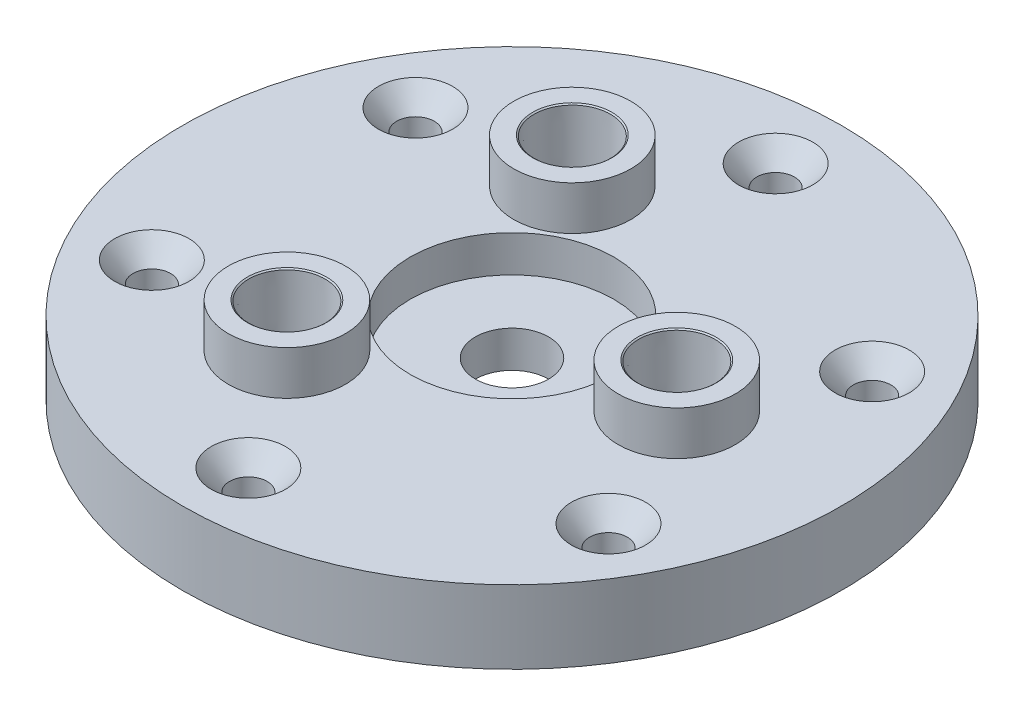
ISO-10303-21;
HEADER;
FILE_DESCRIPTION(('STEP AP214'),'2;1');
FILE_NAME('part.step','',(''),(''),'','','');
FILE_SCHEMA(('AUTOMOTIVE_DESIGN { 1 0 10303 214 1 1 1 1 }'));
ENDSEC;
DATA;
#1=APPLICATION_CONTEXT('core data for automotive mechanical design processes');
#2=APPLICATION_PROTOCOL_DEFINITION('international standard','automotive_design',2000,#1);
#3=PRODUCT_CONTEXT('',#1,'mechanical');
#4=PRODUCT('Part','Part','',(#3));
#5=PRODUCT_RELATED_PRODUCT_CATEGORY('part','',(#4));
#6=PRODUCT_DEFINITION_FORMATION('','',#4);
#7=PRODUCT_DEFINITION_CONTEXT('part definition',#1,'design');
#8=PRODUCT_DEFINITION('design','',#6,#7);
#9=PRODUCT_DEFINITION_SHAPE('','',#8);
#10=(LENGTH_UNIT() NAMED_UNIT(*) SI_UNIT(.MILLI.,.METRE.));
#11=(NAMED_UNIT(*) PLANE_ANGLE_UNIT() SI_UNIT($,.RADIAN.));
#12=(NAMED_UNIT(*) SI_UNIT($,.STERADIAN.) SOLID_ANGLE_UNIT());
#13=UNCERTAINTY_MEASURE_WITH_UNIT(LENGTH_MEASURE(1.E-05),#10,'distance_accuracy_value','');
#14=(GEOMETRIC_REPRESENTATION_CONTEXT(3) GLOBAL_UNCERTAINTY_ASSIGNED_CONTEXT((#13)) GLOBAL_UNIT_ASSIGNED_CONTEXT((#10,
#11,#12)) REPRESENTATION_CONTEXT('',''));
#15=CARTESIAN_POINT('',(0.,0.,0.));
#16=DIRECTION('',(0.,0.,1.));
#17=DIRECTION('',(1.,0.,0.));
#18=AXIS2_PLACEMENT_3D('',#15,#16,#17);
#19=CARTESIAN_POINT('',(0.,12.7,0.));
#20=DIRECTION('',(0.,1.,0.));
#21=DIRECTION('',(0.,0.,1.));
#22=AXIS2_PLACEMENT_3D('',#19,#20,#21);
#23=PLANE('',#22);
#24=CARTESIAN_POINT('',(28.575,12.7,0.));
#25=DIRECTION('',(0.,1.,0.));
#26=DIRECTION('',(0.,0.,1.));
#27=AXIS2_PLACEMENT_3D('',#24,#25,#26);
#28=CIRCLE('',#27,10.16);
#29=CARTESIAN_POINT('',(28.575,12.7,10.16));
#30=VERTEX_POINT('',#29);
#31=EDGE_CURVE('E92',#30,#30,#28,.T.);
#32=ORIENTED_EDGE('',*,*,#31,.F.);
#33=EDGE_LOOP('',(#32));
#34=FACE_BOUND('',#33,.T.);
#35=CARTESIAN_POINT('',(0.,12.7,0.));
#36=DIRECTION('',(0.,1.,0.));
#37=DIRECTION('',(0.,0.,1.));
#38=AXIS2_PLACEMENT_3D('',#35,#36,#37);
#39=CIRCLE('',#38,17.653);
#40=CARTESIAN_POINT('',(0.,12.7,17.653));
#41=VERTEX_POINT('',#40);
#42=EDGE_CURVE('E170',#41,#41,#39,.T.);
#43=ORIENTED_EDGE('',*,*,#42,.F.);
#44=EDGE_LOOP('',(#43));
#45=FACE_BOUND('',#44,.T.);
#46=CARTESIAN_POINT('',(0.,12.7,0.));
#47=DIRECTION('',(0.,1.,0.));
#48=DIRECTION('',(0.,0.,1.));
#49=AXIS2_PLACEMENT_3D('',#46,#47,#48);
#50=CIRCLE('',#49,57.15);
#51=CARTESIAN_POINT('',(0.,12.7,57.15));
#52=VERTEX_POINT('',#51);
#53=EDGE_CURVE('E173',#52,#52,#50,.T.);
#54=ORIENTED_EDGE('',*,*,#53,.T.);
#55=EDGE_LOOP('',(#54));
#56=FACE_BOUND('',#55,.T.);
#57=CARTESIAN_POINT('',(0.,12.7,-45.72));
#58=DIRECTION('',(0.,1.,0.));
#59=DIRECTION('',(0.,0.,1.));
#60=AXIS2_PLACEMENT_3D('',#57,#58,#59);
#61=CIRCLE('',#60,6.4389);
#62=CARTESIAN_POINT('',(0.,12.7,-39.2811));
#63=VERTEX_POINT('',#62);
#64=EDGE_CURVE('E151',#63,#63,#61,.T.);
#65=ORIENTED_EDGE('',*,*,#64,.F.);
#66=EDGE_LOOP('',(#65));
#67=FACE_BOUND('',#66,.T.);
#68=CARTESIAN_POINT('',(-39.5946814610246,12.7,-22.8599999999999));
#69=DIRECTION('',(0.,1.,0.));
#70=DIRECTION('',(0.,0.,1.));
#71=AXIS2_PLACEMENT_3D('',#68,#69,#70);
#72=CIRCLE('',#71,6.4389);
#73=CARTESIAN_POINT('',(-39.5946814610246,12.7,-16.4210999999999));
#74=VERTEX_POINT('',#73);
#75=EDGE_CURVE('E142',#74,#74,#72,.T.);
#76=ORIENTED_EDGE('',*,*,#75,.F.);
#77=EDGE_LOOP('',(#76));
#78=FACE_BOUND('',#77,.T.);
#79=CARTESIAN_POINT('',(-39.5946814610244,12.7,22.8600000000002));
#80=DIRECTION('',(0.,1.,0.));
#81=DIRECTION('',(0.,0.,1.));
#82=AXIS2_PLACEMENT_3D('',#79,#80,#81);
#83=CIRCLE('',#82,6.4389);
#84=CARTESIAN_POINT('',(-39.5946814610244,12.7,29.2989000000002));
#85=VERTEX_POINT('',#84);
#86=EDGE_CURVE('E133',#85,#85,#83,.T.);
#87=ORIENTED_EDGE('',*,*,#86,.F.);
#88=EDGE_LOOP('',(#87));
#89=FACE_BOUND('',#88,.T.);
#90=CARTESIAN_POINT('',(0.,12.7,45.72));
#91=DIRECTION('',(0.,1.,0.));
#92=DIRECTION('',(0.,0.,1.));
#93=AXIS2_PLACEMENT_3D('',#90,#91,#92);
#94=CIRCLE('',#93,6.4389);
#95=CARTESIAN_POINT('',(0.,12.7,52.1589));
#96=VERTEX_POINT('',#95);
#97=EDGE_CURVE('E124',#96,#96,#94,.T.);
#98=ORIENTED_EDGE('',*,*,#97,.F.);
#99=EDGE_LOOP('',(#98));
#100=FACE_BOUND('',#99,.T.);
#101=CARTESIAN_POINT('',(39.5946814610247,12.7,22.8599999999996));
#102=DIRECTION('',(0.,1.,0.));
#103=DIRECTION('',(0.,0.,1.));
#104=AXIS2_PLACEMENT_3D('',#101,#102,#103);
#105=CIRCLE('',#104,6.4389);
#106=CARTESIAN_POINT('',(39.5946814610247,12.7,29.2988999999996));
#107=VERTEX_POINT('',#106);
#108=EDGE_CURVE('E115',#107,#107,#105,.T.);
#109=ORIENTED_EDGE('',*,*,#108,.F.);
#110=EDGE_LOOP('',(#109));
#111=FACE_BOUND('',#110,.T.);
#112=CARTESIAN_POINT('',(39.5946814610243,12.7,-22.8600000000005));
#113=DIRECTION('',(0.,1.,0.));
#114=DIRECTION('',(0.,0.,1.));
#115=AXIS2_PLACEMENT_3D('',#112,#113,#114);
#116=CIRCLE('',#115,6.4389);
#117=CARTESIAN_POINT('',(39.5946814610243,12.7,-16.4211000000005));
#118=VERTEX_POINT('',#117);
#119=EDGE_CURVE('E104',#118,#118,#116,.T.);
#120=ORIENTED_EDGE('',*,*,#119,.F.);
#121=EDGE_LOOP('',(#120));
#122=FACE_BOUND('',#121,.T.);
#123=CARTESIAN_POINT('',(-14.2875,12.7,-24.7466759131403));
#124=DIRECTION('',(0.,1.,0.));
#125=DIRECTION('',(0.,0.,1.));
#126=AXIS2_PLACEMENT_3D('',#123,#124,#125);
#127=CIRCLE('',#126,10.16);
#128=CARTESIAN_POINT('',(-14.2875,12.7,-14.5866759131403));
#129=VERTEX_POINT('',#128);
#130=EDGE_CURVE('E98',#129,#129,#127,.T.);
#131=ORIENTED_EDGE('',*,*,#130,.F.);
#132=EDGE_LOOP('',(#131));
#133=FACE_BOUND('',#132,.T.);
#134=CARTESIAN_POINT('',(-14.2875,12.7,24.7466759131403));
#135=DIRECTION('',(0.,1.,0.));
#136=DIRECTION('',(0.,0.,1.));
#137=AXIS2_PLACEMENT_3D('',#134,#135,#136);
#138=CIRCLE('',#137,10.16);
#139=CARTESIAN_POINT('',(-14.2875,12.7,34.9066759131403));
#140=VERTEX_POINT('',#139);
#141=EDGE_CURVE('E58',#140,#140,#138,.T.);
#142=ORIENTED_EDGE('',*,*,#141,.F.);
#143=EDGE_LOOP('',(#142));
#144=FACE_BOUND('',#143,.T.);
#145=ADVANCED_FACE('F39',(#34,#45,#56,#67,#78,#89,#100,#111,#122,#133,#144),#23,.T.);
#146=CARTESIAN_POINT('',(0.,6.35,0.));
#147=DIRECTION('',(0.,1.,0.));
#148=DIRECTION('',(0.,0.,1.));
#149=AXIS2_PLACEMENT_3D('',#146,#147,#148);
#150=PLANE('',#149);
#151=CARTESIAN_POINT('',(0.,6.35,0.));
#152=DIRECTION('',(0.,1.,0.));
#153=DIRECTION('',(0.,0.,1.));
#154=AXIS2_PLACEMENT_3D('',#151,#152,#153);
#155=CIRCLE('',#154,6.35);
#156=CARTESIAN_POINT('',(0.,6.35,6.35));
#157=VERTEX_POINT('',#156);
#158=EDGE_CURVE('E47',#157,#157,#155,.T.);
#159=ORIENTED_EDGE('',*,*,#158,.F.);
#160=EDGE_LOOP('',(#159));
#161=FACE_BOUND('',#160,.T.);
#162=CARTESIAN_POINT('',(0.,6.35,0.));
#163=DIRECTION('',(0.,1.,0.));
#164=DIRECTION('',(0.,0.,1.));
#165=AXIS2_PLACEMENT_3D('',#162,#163,#164);
#166=CIRCLE('',#165,17.653);
#167=CARTESIAN_POINT('',(0.,6.35,17.653));
#168=VERTEX_POINT('',#167);
#169=EDGE_CURVE('E164',#168,#168,#166,.T.);
#170=ORIENTED_EDGE('',*,*,#169,.T.);
#171=EDGE_LOOP('',(#170));
#172=FACE_BOUND('',#171,.T.);
#173=ADVANCED_FACE('F199',(#161,#172),#150,.T.);
#174=CARTESIAN_POINT('',(0.,6.35,0.));
#175=DIRECTION('',(0.,-1.,0.));
#176=DIRECTION('',(0.,0.,-1.));
#177=AXIS2_PLACEMENT_3D('',#174,#175,#176);
#178=CYLINDRICAL_SURFACE('',#177,57.15);
#179=CARTESIAN_POINT('',(0.,0.,0.));
#180=DIRECTION('',(0.,1.,0.));
#181=DIRECTION('',(0.,0.,1.));
#182=AXIS2_PLACEMENT_3D('',#179,#180,#181);
#183=CIRCLE('',#182,57.15);
#184=CARTESIAN_POINT('',(0.,0.,57.15));
#185=VERTEX_POINT('',#184);
#186=EDGE_CURVE('E10',#185,#185,#183,.T.);
#187=ORIENTED_EDGE('',*,*,#186,.T.);
#188=EDGE_LOOP('',(#187));
#189=FACE_BOUND('',#188,.T.);
#190=ORIENTED_EDGE('',*,*,#53,.F.);
#191=EDGE_LOOP('',(#190));
#192=FACE_BOUND('',#191,.T.);
#193=ADVANCED_FACE('F41',(#189,#192),#178,.T.);
#194=CARTESIAN_POINT('',(0.,0.,0.));
#195=DIRECTION('',(0.,1.,0.));
#196=DIRECTION('',(0.,0.,1.));
#197=AXIS2_PLACEMENT_3D('',#194,#195,#196);
#198=PLANE('',#197);
#199=CARTESIAN_POINT('',(39.5946814610243,0.,-22.8600000000005));
#200=DIRECTION('',(0.,1.,0.));
#201=DIRECTION('',(0.,0.,1.));
#202=AXIS2_PLACEMENT_3D('',#199,#200,#201);
#203=CIRCLE('',#202,3.2639);
#204=CARTESIAN_POINT('',(39.5946814610243,0.,-19.5961000000005));
#205=VERTEX_POINT('',#204);
#206=EDGE_CURVE('E112',#205,#205,#203,.T.);
#207=ORIENTED_EDGE('',*,*,#206,.T.);
#208=EDGE_LOOP('',(#207));
#209=FACE_BOUND('',#208,.T.);
#210=CARTESIAN_POINT('',(39.5946814610247,0.,22.8599999999996));
#211=DIRECTION('',(0.,1.,0.));
#212=DIRECTION('',(0.,0.,1.));
#213=AXIS2_PLACEMENT_3D('',#210,#211,#212);
#214=CIRCLE('',#213,3.26389999999999);
#215=CARTESIAN_POINT('',(39.5946814610247,0.,26.1238999999996));
#216=VERTEX_POINT('',#215);
#217=EDGE_CURVE('E121',#216,#216,#214,.T.);
#218=ORIENTED_EDGE('',*,*,#217,.T.);
#219=EDGE_LOOP('',(#218));
#220=FACE_BOUND('',#219,.T.);
#221=CARTESIAN_POINT('',(0.,0.,45.72));
#222=DIRECTION('',(0.,1.,0.));
#223=DIRECTION('',(0.,0.,1.));
#224=AXIS2_PLACEMENT_3D('',#221,#222,#223);
#225=CIRCLE('',#224,3.2639);
#226=CARTESIAN_POINT('',(0.,0.,48.9839));
#227=VERTEX_POINT('',#226);
#228=EDGE_CURVE('E130',#227,#227,#225,.T.);
#229=ORIENTED_EDGE('',*,*,#228,.T.);
#230=EDGE_LOOP('',(#229));
#231=FACE_BOUND('',#230,.T.);
#232=CARTESIAN_POINT('',(-39.5946814610244,0.,22.8600000000002));
#233=DIRECTION('',(0.,1.,0.));
#234=DIRECTION('',(0.,0.,1.));
#235=AXIS2_PLACEMENT_3D('',#232,#233,#234);
#236=CIRCLE('',#235,3.2639);
#237=CARTESIAN_POINT('',(-39.5946814610244,0.,26.1239000000002));
#238=VERTEX_POINT('',#237);
#239=EDGE_CURVE('E139',#238,#238,#236,.T.);
#240=ORIENTED_EDGE('',*,*,#239,.T.);
#241=EDGE_LOOP('',(#240));
#242=FACE_BOUND('',#241,.T.);
#243=CARTESIAN_POINT('',(-39.5946814610246,0.,-22.8599999999999));
#244=DIRECTION('',(0.,1.,0.));
#245=DIRECTION('',(0.,0.,1.));
#246=AXIS2_PLACEMENT_3D('',#243,#244,#245);
#247=CIRCLE('',#246,3.2639);
#248=CARTESIAN_POINT('',(-39.5946814610246,0.,-19.5960999999999));
#249=VERTEX_POINT('',#248);
#250=EDGE_CURVE('E148',#249,#249,#247,.T.);
#251=ORIENTED_EDGE('',*,*,#250,.T.);
#252=EDGE_LOOP('',(#251));
#253=FACE_BOUND('',#252,.T.);
#254=CARTESIAN_POINT('',(0.,0.,-45.72));
#255=DIRECTION('',(0.,1.,0.));
#256=DIRECTION('',(0.,0.,1.));
#257=AXIS2_PLACEMENT_3D('',#254,#255,#256);
#258=CIRCLE('',#257,3.2639);
#259=CARTESIAN_POINT('',(0.,0.,-42.4561));
#260=VERTEX_POINT('',#259);
#261=EDGE_CURVE('E157',#260,#260,#258,.T.);
#262=ORIENTED_EDGE('',*,*,#261,.T.);
#263=EDGE_LOOP('',(#262));
#264=FACE_BOUND('',#263,.T.);
#265=CARTESIAN_POINT('',(28.575,0.,0.));
#266=DIRECTION('',(0.,1.,0.));
#267=DIRECTION('',(0.,0.,1.));
#268=AXIS2_PLACEMENT_3D('',#265,#266,#267);
#269=CIRCLE('',#268,3.175);
#270=CARTESIAN_POINT('',(28.575,0.,3.175));
#271=VERTEX_POINT('',#270);
#272=EDGE_CURVE('E161',#271,#271,#269,.T.);
#273=ORIENTED_EDGE('',*,*,#272,.T.);
#274=EDGE_LOOP('',(#273));
#275=FACE_BOUND('',#274,.T.);
#276=CARTESIAN_POINT('',(-14.2875,0.,24.7466759131403));
#277=DIRECTION('',(0.,1.,0.));
#278=DIRECTION('',(0.,0.,1.));
#279=AXIS2_PLACEMENT_3D('',#276,#277,#278);
#280=CIRCLE('',#279,3.175);
#281=CARTESIAN_POINT('',(-14.2875,0.,27.9216759131403));
#282=VERTEX_POINT('',#281);
#283=EDGE_CURVE('E165',#282,#282,#280,.T.);
#284=ORIENTED_EDGE('',*,*,#283,.T.);
#285=EDGE_LOOP('',(#284));
#286=FACE_BOUND('',#285,.T.);
#287=CARTESIAN_POINT('',(-14.2875,0.,-24.7466759131403));
#288=DIRECTION('',(0.,1.,0.));
#289=DIRECTION('',(0.,0.,1.));
#290=AXIS2_PLACEMENT_3D('',#287,#288,#289);
#291=CIRCLE('',#290,3.175);
#292=CARTESIAN_POINT('',(-14.2875,0.,-21.5716759131403));
#293=VERTEX_POINT('',#292);
#294=EDGE_CURVE('E160',#293,#293,#291,.T.);
#295=ORIENTED_EDGE('',*,*,#294,.T.);
#296=EDGE_LOOP('',(#295));
#297=FACE_BOUND('',#296,.T.);
#298=CARTESIAN_POINT('',(0.,0.,0.));
#299=DIRECTION('',(0.,1.,0.));
#300=DIRECTION('',(0.,0.,1.));
#301=AXIS2_PLACEMENT_3D('',#298,#299,#300);
#302=CIRCLE('',#301,6.35);
#303=CARTESIAN_POINT('',(0.,0.,6.35));
#304=VERTEX_POINT('',#303);
#305=EDGE_CURVE('E52',#304,#304,#302,.T.);
#306=ORIENTED_EDGE('',*,*,#305,.T.);
#307=EDGE_LOOP('',(#306));
#308=FACE_BOUND('',#307,.T.);
#309=ORIENTED_EDGE('',*,*,#186,.F.);
#310=EDGE_LOOP('',(#309));
#311=FACE_BOUND('',#310,.T.);
#312=ADVANCED_FACE('F180',(#209,#220,#231,#242,#253,#264,#275,#286,#297,#308,#311),#198,.F.);
#313=CARTESIAN_POINT('',(0.,0.,0.));
#314=DIRECTION('',(0.,1.,0.));
#315=DIRECTION('',(0.,0.,1.));
#316=AXIS2_PLACEMENT_3D('',#313,#314,#315);
#317=CYLINDRICAL_SURFACE('',#316,6.35);
#318=ORIENTED_EDGE('',*,*,#158,.T.);
#319=EDGE_LOOP('',(#318));
#320=FACE_BOUND('',#319,.T.);
#321=ORIENTED_EDGE('',*,*,#305,.F.);
#322=EDGE_LOOP('',(#321));
#323=FACE_BOUND('',#322,.T.);
#324=ADVANCED_FACE('F183',(#320,#323),#317,.F.);
#325=CARTESIAN_POINT('',(0.,12.7,0.));
#326=DIRECTION('',(0.,-1.,0.));
#327=DIRECTION('',(0.,0.,-1.));
#328=AXIS2_PLACEMENT_3D('',#325,#326,#327);
#329=CYLINDRICAL_SURFACE('',#328,17.653);
#330=ORIENTED_EDGE('',*,*,#42,.T.);
#331=EDGE_LOOP('',(#330));
#332=FACE_BOUND('',#331,.T.);
#333=ORIENTED_EDGE('',*,*,#169,.F.);
#334=EDGE_LOOP('',(#333));
#335=FACE_BOUND('',#334,.T.);
#336=ADVANCED_FACE('F185',(#332,#335),#329,.F.);
#337=CARTESIAN_POINT('',(-14.2875,0.,-24.7466759131403));
#338=DIRECTION('',(0.,1.,0.));
#339=DIRECTION('',(0.,0.,1.));
#340=AXIS2_PLACEMENT_3D('',#337,#338,#339);
#341=CYLINDRICAL_SURFACE('',#340,3.175);
#342=CARTESIAN_POINT('',(-14.2875,1.8165851860098,-24.7466759131403));
#343=DIRECTION('',(0.,1.,0.));
#344=DIRECTION('',(0.,0.,1.));
#345=AXIS2_PLACEMENT_3D('',#342,#343,#344);
#346=CIRCLE('',#345,3.175);
#347=CARTESIAN_POINT('',(-14.2875,1.8165851860098,-21.5716759131403));
#348=VERTEX_POINT('',#347);
#349=EDGE_CURVE('E43',#348,#348,#346,.T.);
#350=ORIENTED_EDGE('',*,*,#349,.T.);
#351=EDGE_LOOP('',(#350));
#352=FACE_BOUND('',#351,.T.);
#353=ORIENTED_EDGE('',*,*,#294,.F.);
#354=EDGE_LOOP('',(#353));
#355=FACE_BOUND('',#354,.T.);
#356=ADVANCED_FACE('F192',(#352,#355),#341,.F.);
#357=CARTESIAN_POINT('',(-14.2875,0.,24.7466759131403));
#358=DIRECTION('',(0.,1.,0.));
#359=DIRECTION('',(0.,0.,1.));
#360=AXIS2_PLACEMENT_3D('',#357,#358,#359);
#361=CYLINDRICAL_SURFACE('',#360,3.175);
#362=CARTESIAN_POINT('',(-14.2875,1.8165851860098,24.7466759131403));
#363=DIRECTION('',(0.,1.,0.));
#364=DIRECTION('',(0.,0.,1.));
#365=AXIS2_PLACEMENT_3D('',#362,#363,#364);
#366=CIRCLE('',#365,3.175);
#367=CARTESIAN_POINT('',(-14.2875,1.8165851860098,27.9216759131403));
#368=VERTEX_POINT('',#367);
#369=EDGE_CURVE('E56',#368,#368,#366,.T.);
#370=ORIENTED_EDGE('',*,*,#369,.T.);
#371=EDGE_LOOP('',(#370));
#372=FACE_BOUND('',#371,.T.);
#373=ORIENTED_EDGE('',*,*,#283,.F.);
#374=EDGE_LOOP('',(#373));
#375=FACE_BOUND('',#374,.T.);
#376=ADVANCED_FACE('F210',(#372,#375),#361,.F.);
#377=CARTESIAN_POINT('',(28.575,0.,0.));
#378=DIRECTION('',(0.,1.,0.));
#379=DIRECTION('',(0.,0.,1.));
#380=AXIS2_PLACEMENT_3D('',#377,#378,#379);
#381=CYLINDRICAL_SURFACE('',#380,3.175);
#382=CARTESIAN_POINT('',(28.575,1.8165851860098,0.));
#383=DIRECTION('',(0.,1.,0.));
#384=DIRECTION('',(0.,0.,1.));
#385=AXIS2_PLACEMENT_3D('',#382,#383,#384);
#386=CIRCLE('',#385,3.175);
#387=CARTESIAN_POINT('',(28.575,1.8165851860098,3.175));
#388=VERTEX_POINT('',#387);
#389=EDGE_CURVE('E60',#388,#388,#386,.T.);
#390=ORIENTED_EDGE('',*,*,#389,.T.);
#391=EDGE_LOOP('',(#390));
#392=FACE_BOUND('',#391,.T.);
#393=ORIENTED_EDGE('',*,*,#272,.F.);
#394=EDGE_LOOP('',(#393));
#395=FACE_BOUND('',#394,.T.);
#396=ADVANCED_FACE('F214',(#392,#395),#381,.F.);
#397=CARTESIAN_POINT('',(0.,12.7,-45.72));
#398=DIRECTION('',(0.,1.,0.));
#399=DIRECTION('',(0.,0.,1.));
#400=AXIS2_PLACEMENT_3D('',#397,#398,#399);
#401=CYLINDRICAL_SURFACE('',#400,3.2639);
#402=ORIENTED_EDGE('',*,*,#261,.F.);
#403=EDGE_LOOP('',(#402));
#404=FACE_BOUND('',#403,.T.);
#405=CARTESIAN_POINT('',(0.,9.04758030707329,-45.72));
#406=DIRECTION('',(0.,1.,0.));
#407=DIRECTION('',(0.,0.,1.));
#408=AXIS2_PLACEMENT_3D('',#405,#406,#407);
#409=CIRCLE('',#408,3.2639);
#410=CARTESIAN_POINT('',(0.,9.04758030707329,-42.4561));
#411=VERTEX_POINT('',#410);
#412=EDGE_CURVE('E154',#411,#411,#409,.T.);
#413=ORIENTED_EDGE('',*,*,#412,.T.);
#414=EDGE_LOOP('',(#413));
#415=FACE_BOUND('',#414,.T.);
#416=ADVANCED_FACE('F218',(#404,#415),#401,.F.);
#417=CARTESIAN_POINT('',(0.,12.7,-45.72));
#418=DIRECTION('',(0.,1.,0.));
#419=DIRECTION('',(0.,0.,1.));
#420=AXIS2_PLACEMENT_3D('',#417,#418,#419);
#421=CONICAL_SURFACE('',#420,6.4389,0.715584993317675);
#422=ORIENTED_EDGE('',*,*,#412,.F.);
#423=EDGE_LOOP('',(#422));
#424=FACE_BOUND('',#423,.T.);
#425=ORIENTED_EDGE('',*,*,#64,.T.);
#426=EDGE_LOOP('',(#425));
#427=FACE_BOUND('',#426,.T.);
#428=ADVANCED_FACE('F221',(#424,#427),#421,.F.);
#429=CARTESIAN_POINT('',(-39.5946814610246,12.7,-22.8599999999999));
#430=DIRECTION('',(0.,1.,0.));
#431=DIRECTION('',(0.,0.,1.));
#432=AXIS2_PLACEMENT_3D('',#429,#430,#431);
#433=CYLINDRICAL_SURFACE('',#432,3.2639);
#434=ORIENTED_EDGE('',*,*,#250,.F.);
#435=EDGE_LOOP('',(#434));
#436=FACE_BOUND('',#435,.T.);
#437=CARTESIAN_POINT('',(-39.5946814610246,9.04758030707329,-22.8599999999999));
#438=DIRECTION('',(0.,1.,0.));
#439=DIRECTION('',(0.,0.,1.));
#440=AXIS2_PLACEMENT_3D('',#437,#438,#439);
#441=CIRCLE('',#440,3.2639);
#442=CARTESIAN_POINT('',(-39.5946814610246,9.04758030707329,-19.5960999999999));
#443=VERTEX_POINT('',#442);
#444=EDGE_CURVE('E145',#443,#443,#441,.T.);
#445=ORIENTED_EDGE('',*,*,#444,.T.);
#446=EDGE_LOOP('',(#445));
#447=FACE_BOUND('',#446,.T.);
#448=ADVANCED_FACE('F225',(#436,#447),#433,.F.);
#449=CARTESIAN_POINT('',(-39.5946814610246,12.7,-22.8599999999999));
#450=DIRECTION('',(0.,1.,0.));
#451=DIRECTION('',(0.,0.,1.));
#452=AXIS2_PLACEMENT_3D('',#449,#450,#451);
#453=CONICAL_SURFACE('',#452,6.4389,0.715584993317674);
#454=ORIENTED_EDGE('',*,*,#444,.F.);
#455=EDGE_LOOP('',(#454));
#456=FACE_BOUND('',#455,.T.);
#457=ORIENTED_EDGE('',*,*,#75,.T.);
#458=EDGE_LOOP('',(#457));
#459=FACE_BOUND('',#458,.T.);
#460=ADVANCED_FACE('F229',(#456,#459),#453,.F.);
#461=CARTESIAN_POINT('',(-39.5946814610244,12.7,22.8600000000002));
#462=DIRECTION('',(0.,1.,0.));
#463=DIRECTION('',(0.,0.,1.));
#464=AXIS2_PLACEMENT_3D('',#461,#462,#463);
#465=CYLINDRICAL_SURFACE('',#464,3.2639);
#466=ORIENTED_EDGE('',*,*,#239,.F.);
#467=EDGE_LOOP('',(#466));
#468=FACE_BOUND('',#467,.T.);
#469=CARTESIAN_POINT('',(-39.5946814610244,9.04758030707329,22.8600000000002));
#470=DIRECTION('',(0.,1.,0.));
#471=DIRECTION('',(0.,0.,1.));
#472=AXIS2_PLACEMENT_3D('',#469,#470,#471);
#473=CIRCLE('',#472,3.2639);
#474=CARTESIAN_POINT('',(-39.5946814610244,9.04758030707329,26.1239000000002));
#475=VERTEX_POINT('',#474);
#476=EDGE_CURVE('E136',#475,#475,#473,.T.);
#477=ORIENTED_EDGE('',*,*,#476,.T.);
#478=EDGE_LOOP('',(#477));
#479=FACE_BOUND('',#478,.T.);
#480=ADVANCED_FACE('F233',(#468,#479),#465,.F.);
#481=CARTESIAN_POINT('',(-39.5946814610244,12.7,22.8600000000002));
#482=DIRECTION('',(0.,1.,0.));
#483=DIRECTION('',(0.,0.,1.));
#484=AXIS2_PLACEMENT_3D('',#481,#482,#483);
#485=CONICAL_SURFACE('',#484,6.4389,0.715584993317674);
#486=ORIENTED_EDGE('',*,*,#476,.F.);
#487=EDGE_LOOP('',(#486));
#488=FACE_BOUND('',#487,.T.);
#489=ORIENTED_EDGE('',*,*,#86,.T.);
#490=EDGE_LOOP('',(#489));
#491=FACE_BOUND('',#490,.T.);
#492=ADVANCED_FACE('F237',(#488,#491),#485,.F.);
#493=CARTESIAN_POINT('',(0.,12.7,45.72));
#494=DIRECTION('',(0.,1.,0.));
#495=DIRECTION('',(0.,0.,1.));
#496=AXIS2_PLACEMENT_3D('',#493,#494,#495);
#497=CYLINDRICAL_SURFACE('',#496,3.2639);
#498=ORIENTED_EDGE('',*,*,#228,.F.);
#499=EDGE_LOOP('',(#498));
#500=FACE_BOUND('',#499,.T.);
#501=CARTESIAN_POINT('',(0.,9.04758030707329,45.72));
#502=DIRECTION('',(0.,1.,0.));
#503=DIRECTION('',(0.,0.,1.));
#504=AXIS2_PLACEMENT_3D('',#501,#502,#503);
#505=CIRCLE('',#504,3.2639);
#506=CARTESIAN_POINT('',(0.,9.04758030707329,48.9839));
#507=VERTEX_POINT('',#506);
#508=EDGE_CURVE('E127',#507,#507,#505,.T.);
#509=ORIENTED_EDGE('',*,*,#508,.T.);
#510=EDGE_LOOP('',(#509));
#511=FACE_BOUND('',#510,.T.);
#512=ADVANCED_FACE('F241',(#500,#511),#497,.F.);
#513=CARTESIAN_POINT('',(0.,12.7,45.72));
#514=DIRECTION('',(0.,1.,0.));
#515=DIRECTION('',(0.,0.,1.));
#516=AXIS2_PLACEMENT_3D('',#513,#514,#515);
#517=CONICAL_SURFACE('',#516,6.4389,0.715584993317675);
#518=ORIENTED_EDGE('',*,*,#508,.F.);
#519=EDGE_LOOP('',(#518));
#520=FACE_BOUND('',#519,.T.);
#521=ORIENTED_EDGE('',*,*,#97,.T.);
#522=EDGE_LOOP('',(#521));
#523=FACE_BOUND('',#522,.T.);
#524=ADVANCED_FACE('F245',(#520,#523),#517,.F.);
#525=CARTESIAN_POINT('',(39.5946814610247,12.7,22.8599999999996));
#526=DIRECTION('',(0.,1.,0.));
#527=DIRECTION('',(0.,0.,1.));
#528=AXIS2_PLACEMENT_3D('',#525,#526,#527);
#529=CYLINDRICAL_SURFACE('',#528,3.2639);
#530=ORIENTED_EDGE('',*,*,#217,.F.);
#531=EDGE_LOOP('',(#530));
#532=FACE_BOUND('',#531,.T.);
#533=CARTESIAN_POINT('',(39.5946814610247,9.04758030707329,22.8599999999996));
#534=DIRECTION('',(0.,1.,0.));
#535=DIRECTION('',(0.,0.,1.));
#536=AXIS2_PLACEMENT_3D('',#533,#534,#535);
#537=CIRCLE('',#536,3.2639);
#538=CARTESIAN_POINT('',(39.5946814610247,9.04758030707329,26.1238999999996));
#539=VERTEX_POINT('',#538);
#540=EDGE_CURVE('E118',#539,#539,#537,.T.);
#541=ORIENTED_EDGE('',*,*,#540,.T.);
#542=EDGE_LOOP('',(#541));
#543=FACE_BOUND('',#542,.T.);
#544=ADVANCED_FACE('F249',(#532,#543),#529,.F.);
#545=CARTESIAN_POINT('',(39.5946814610247,12.7,22.8599999999996));
#546=DIRECTION('',(0.,1.,0.));
#547=DIRECTION('',(0.,0.,1.));
#548=AXIS2_PLACEMENT_3D('',#545,#546,#547);
#549=CONICAL_SURFACE('',#548,6.4389,0.715584993317674);
#550=ORIENTED_EDGE('',*,*,#540,.F.);
#551=EDGE_LOOP('',(#550));
#552=FACE_BOUND('',#551,.T.);
#553=ORIENTED_EDGE('',*,*,#108,.T.);
#554=EDGE_LOOP('',(#553));
#555=FACE_BOUND('',#554,.T.);
#556=ADVANCED_FACE('F253',(#552,#555),#549,.F.);
#557=CARTESIAN_POINT('',(39.5946814610243,12.7,-22.8600000000005));
#558=DIRECTION('',(0.,1.,0.));
#559=DIRECTION('',(0.,0.,1.));
#560=AXIS2_PLACEMENT_3D('',#557,#558,#559);
#561=CYLINDRICAL_SURFACE('',#560,3.2639);
#562=ORIENTED_EDGE('',*,*,#206,.F.);
#563=EDGE_LOOP('',(#562));
#564=FACE_BOUND('',#563,.T.);
#565=CARTESIAN_POINT('',(39.5946814610243,9.04758030707329,-22.8600000000005));
#566=DIRECTION('',(0.,1.,0.));
#567=DIRECTION('',(0.,0.,1.));
#568=AXIS2_PLACEMENT_3D('',#565,#566,#567);
#569=CIRCLE('',#568,3.2639);
#570=CARTESIAN_POINT('',(39.5946814610243,9.04758030707329,-19.5961000000005));
#571=VERTEX_POINT('',#570);
#572=EDGE_CURVE('E109',#571,#571,#569,.T.);
#573=ORIENTED_EDGE('',*,*,#572,.T.);
#574=EDGE_LOOP('',(#573));
#575=FACE_BOUND('',#574,.T.);
#576=ADVANCED_FACE('F257',(#564,#575),#561,.F.);
#577=CARTESIAN_POINT('',(39.5946814610243,12.7,-22.8600000000005));
#578=DIRECTION('',(0.,1.,0.));
#579=DIRECTION('',(0.,0.,1.));
#580=AXIS2_PLACEMENT_3D('',#577,#578,#579);
#581=CONICAL_SURFACE('',#580,6.4389,0.715584993317674);
#582=ORIENTED_EDGE('',*,*,#572,.F.);
#583=EDGE_LOOP('',(#582));
#584=FACE_BOUND('',#583,.T.);
#585=ORIENTED_EDGE('',*,*,#119,.T.);
#586=EDGE_LOOP('',(#585));
#587=FACE_BOUND('',#586,.T.);
#588=ADVANCED_FACE('F261',(#584,#587),#581,.F.);
#589=CARTESIAN_POINT('',(-14.2875,20.32,-24.7466759131403));
#590=DIRECTION('',(0.,1.,0.));
#591=DIRECTION('',(0.,0.,1.));
#592=AXIS2_PLACEMENT_3D('',#589,#590,#591);
#593=PLANE('',#592);
#594=CARTESIAN_POINT('',(-14.2875,20.32,-24.7466759131403));
#595=DIRECTION('',(0.,1.,0.));
#596=DIRECTION('',(0.,0.,1.));
#597=AXIS2_PLACEMENT_3D('',#594,#595,#596);
#598=CIRCLE('',#597,6.858);
#599=CARTESIAN_POINT('',(-14.2875,20.32,-17.8886759131403));
#600=VERTEX_POINT('',#599);
#601=EDGE_CURVE('E356',#600,#600,#598,.T.);
#602=ORIENTED_EDGE('',*,*,#601,.F.);
#603=EDGE_LOOP('',(#602));
#604=FACE_BOUND('',#603,.T.);
#605=CARTESIAN_POINT('',(-14.2875,20.32,-24.7466759131403));
#606=DIRECTION('',(0.,1.,0.));
#607=DIRECTION('',(0.,0.,1.));
#608=AXIS2_PLACEMENT_3D('',#605,#606,#607);
#609=CIRCLE('',#608,10.16);
#610=CARTESIAN_POINT('',(-14.2875,20.32,-14.5866759131403));
#611=VERTEX_POINT('',#610);
#612=EDGE_CURVE('E101',#611,#611,#609,.T.);
#613=ORIENTED_EDGE('',*,*,#612,.T.);
#614=EDGE_LOOP('',(#613));
#615=FACE_BOUND('',#614,.T.);
#616=ADVANCED_FACE('F265',(#604,#615),#593,.T.);
#617=CARTESIAN_POINT('',(-14.2875,20.32,-24.7466759131403));
#618=DIRECTION('',(0.,-1.,0.));
#619=DIRECTION('',(0.,0.,-1.));
#620=AXIS2_PLACEMENT_3D('',#617,#618,#619);
#621=CYLINDRICAL_SURFACE('',#620,10.16);
#622=ORIENTED_EDGE('',*,*,#612,.F.);
#623=EDGE_LOOP('',(#622));
#624=FACE_BOUND('',#623,.T.);
#625=ORIENTED_EDGE('',*,*,#130,.T.);
#626=EDGE_LOOP('',(#625));
#627=FACE_BOUND('',#626,.T.);
#628=ADVANCED_FACE('F267',(#624,#627),#621,.T.);
#629=CARTESIAN_POINT('',(28.575,20.32,0.));
#630=DIRECTION('',(0.,1.,0.));
#631=DIRECTION('',(0.,0.,1.));
#632=AXIS2_PLACEMENT_3D('',#629,#630,#631);
#633=PLANE('',#632);
#634=CARTESIAN_POINT('',(28.575,20.32,0.));
#635=DIRECTION('',(0.,1.,0.));
#636=DIRECTION('',(0.,0.,1.));
#637=AXIS2_PLACEMENT_3D('',#634,#635,#636);
#638=CIRCLE('',#637,6.858);
#639=CARTESIAN_POINT('',(28.575,20.32,6.858));
#640=VERTEX_POINT('',#639);
#641=EDGE_CURVE('E369',#640,#640,#638,.T.);
#642=ORIENTED_EDGE('',*,*,#641,.F.);
#643=EDGE_LOOP('',(#642));
#644=FACE_BOUND('',#643,.T.);
#645=CARTESIAN_POINT('',(28.575,20.32,0.));
#646=DIRECTION('',(0.,1.,0.));
#647=DIRECTION('',(0.,0.,1.));
#648=AXIS2_PLACEMENT_3D('',#645,#646,#647);
#649=CIRCLE('',#648,10.16);
#650=CARTESIAN_POINT('',(28.575,20.32,10.16));
#651=VERTEX_POINT('',#650);
#652=EDGE_CURVE('E95',#651,#651,#649,.T.);
#653=ORIENTED_EDGE('',*,*,#652,.T.);
#654=EDGE_LOOP('',(#653));
#655=FACE_BOUND('',#654,.T.);
#656=ADVANCED_FACE('F270',(#644,#655),#633,.T.);
#657=CARTESIAN_POINT('',(28.575,20.32,0.));
#658=DIRECTION('',(0.,-1.,0.));
#659=DIRECTION('',(0.,0.,-1.));
#660=AXIS2_PLACEMENT_3D('',#657,#658,#659);
#661=CYLINDRICAL_SURFACE('',#660,10.16);
#662=ORIENTED_EDGE('',*,*,#652,.F.);
#663=EDGE_LOOP('',(#662));
#664=FACE_BOUND('',#663,.T.);
#665=ORIENTED_EDGE('',*,*,#31,.T.);
#666=EDGE_LOOP('',(#665));
#667=FACE_BOUND('',#666,.T.);
#668=ADVANCED_FACE('F275',(#664,#667),#661,.T.);
#669=CARTESIAN_POINT('',(-14.2875,20.32,24.7466759131403));
#670=DIRECTION('',(0.,1.,0.));
#671=DIRECTION('',(0.,0.,1.));
#672=AXIS2_PLACEMENT_3D('',#669,#670,#671);
#673=PLANE('',#672);
#674=CARTESIAN_POINT('',(-14.2875,20.32,24.7466759131403));
#675=DIRECTION('',(0.,1.,0.));
#676=DIRECTION('',(0.,0.,1.));
#677=AXIS2_PLACEMENT_3D('',#674,#675,#676);
#678=CIRCLE('',#677,6.858);
#679=CARTESIAN_POINT('',(-14.2875,20.32,31.6046759131403));
#680=VERTEX_POINT('',#679);
#681=EDGE_CURVE('E62',#680,#680,#678,.T.);
#682=ORIENTED_EDGE('',*,*,#681,.F.);
#683=EDGE_LOOP('',(#682));
#684=FACE_BOUND('',#683,.T.);
#685=CARTESIAN_POINT('',(-14.2875,20.32,24.7466759131403));
#686=DIRECTION('',(0.,1.,0.));
#687=DIRECTION('',(0.,0.,1.));
#688=AXIS2_PLACEMENT_3D('',#685,#686,#687);
#689=CIRCLE('',#688,10.16);
#690=CARTESIAN_POINT('',(-14.2875,20.32,34.9066759131403));
#691=VERTEX_POINT('',#690);
#692=EDGE_CURVE('E89',#691,#691,#689,.T.);
#693=ORIENTED_EDGE('',*,*,#692,.T.);
#694=EDGE_LOOP('',(#693));
#695=FACE_BOUND('',#694,.T.);
#696=ADVANCED_FACE('F278',(#684,#695),#673,.T.);
#697=CARTESIAN_POINT('',(-14.2875,20.32,24.7466759131403));
#698=DIRECTION('',(0.,-1.,0.));
#699=DIRECTION('',(0.,0.,-1.));
#700=AXIS2_PLACEMENT_3D('',#697,#698,#699);
#701=CYLINDRICAL_SURFACE('',#700,10.16);
#702=ORIENTED_EDGE('',*,*,#692,.F.);
#703=EDGE_LOOP('',(#702));
#704=FACE_BOUND('',#703,.T.);
#705=ORIENTED_EDGE('',*,*,#141,.T.);
#706=EDGE_LOOP('',(#705));
#707=FACE_BOUND('',#706,.T.);
#708=ADVANCED_FACE('F283',(#704,#707),#701,.T.);
#709=CARTESIAN_POINT('',(-14.2875,3.2512,24.7466759131403));
#710=DIRECTION('',(0.,1.,0.));
#711=DIRECTION('',(0.,0.,1.));
#712=AXIS2_PLACEMENT_3D('',#709,#710,#711);
#713=CONICAL_SURFACE('',#712,5.5626,1.02974425867665);
#714=CARTESIAN_POINT('',(-14.2875,3.2512,24.7466759131403));
#715=DIRECTION('',(0.,1.,0.));
#716=DIRECTION('',(0.,0.,1.));
#717=AXIS2_PLACEMENT_3D('',#714,#715,#716);
#718=CIRCLE('',#717,5.5626);
#719=CARTESIAN_POINT('',(-14.2875,3.2512,30.3092759131403));
#720=VERTEX_POINT('',#719);
#721=EDGE_CURVE('E59',#720,#720,#718,.T.);
#722=ORIENTED_EDGE('',*,*,#721,.T.);
#723=EDGE_LOOP('',(#722));
#724=FACE_BOUND('',#723,.T.);
#725=ORIENTED_EDGE('',*,*,#369,.F.);
#726=EDGE_LOOP('',(#725));
#727=FACE_BOUND('',#726,.T.);
#728=ADVANCED_FACE('F286',(#724,#727),#713,.F.);
#729=CARTESIAN_POINT('',(-14.2875,20.32,24.7466759131403));
#730=DIRECTION('',(0.,1.,0.));
#731=DIRECTION('',(0.,0.,1.));
#732=AXIS2_PLACEMENT_3D('',#729,#730,#731);
#733=CYLINDRICAL_SURFACE('',#732,5.5626);
#734=ORIENTED_EDGE('',*,*,#721,.F.);
#735=EDGE_LOOP('',(#734));
#736=FACE_BOUND('',#735,.T.);
#737=CARTESIAN_POINT('',(-14.2875,10.2997,24.7466759131403));
#738=DIRECTION('',(0.,1.,0.));
#739=DIRECTION('',(0.,0.,1.));
#740=AXIS2_PLACEMENT_3D('',#737,#738,#739);
#741=CIRCLE('',#740,5.5626);
#742=CARTESIAN_POINT('',(-14.2875,10.2997,30.3092759131403));
#743=VERTEX_POINT('',#742);
#744=EDGE_CURVE('E84',#743,#743,#741,.T.);
#745=ORIENTED_EDGE('',*,*,#744,.T.);
#746=EDGE_LOOP('',(#745));
#747=FACE_BOUND('',#746,.T.);
#748=ADVANCED_FACE('F293',(#736,#747),#733,.F.);
#749=CARTESIAN_POINT('',(-8.72489999999999,10.2997,24.7466759131403));
#750=DIRECTION('',(0.,-1.,0.));
#751=DIRECTION('',(0.,0.,-1.));
#752=AXIS2_PLACEMENT_3D('',#749,#750,#751);
#753=PLANE('',#752);
#754=ORIENTED_EDGE('',*,*,#744,.F.);
#755=EDGE_LOOP('',(#754));
#756=FACE_BOUND('',#755,.T.);
#757=CARTESIAN_POINT('',(-14.2875,10.2997,24.7466759131403));
#758=DIRECTION('',(0.,1.,0.));
#759=DIRECTION('',(0.,0.,1.));
#760=AXIS2_PLACEMENT_3D('',#757,#758,#759);
#761=CIRCLE('',#760,6.33555542465257);
#762=CARTESIAN_POINT('',(-14.2875,10.2997,31.0822313377929));
#763=VERTEX_POINT('',#762);
#764=EDGE_CURVE('E81',#763,#763,#761,.T.);
#765=ORIENTED_EDGE('',*,*,#764,.T.);
#766=EDGE_LOOP('',(#765));
#767=FACE_BOUND('',#766,.T.);
#768=ADVANCED_FACE('F297',(#756,#767),#753,.F.);
#769=CARTESIAN_POINT('',(-14.2875,20.1285548040989,24.7466759131403));
#770=DIRECTION('',(0.,1.,0.));
#771=DIRECTION('',(0.,0.,1.));
#772=AXIS2_PLACEMENT_3D('',#769,#770,#771);
#773=CONICAL_SURFACE('',#772,6.6298445,0.0299323966717024);
#774=ORIENTED_EDGE('',*,*,#764,.F.);
#775=EDGE_LOOP('',(#774));
#776=FACE_BOUND('',#775,.T.);
#777=CARTESIAN_POINT('',(-14.2875,20.1285548040989,24.7466759131403));
#778=DIRECTION('',(0.,1.,0.));
#779=DIRECTION('',(0.,0.,1.));
#780=AXIS2_PLACEMENT_3D('',#777,#778,#779);
#781=CIRCLE('',#780,6.6298445);
#782=CARTESIAN_POINT('',(-14.2875,20.1285548040989,31.3765204131403));
#783=VERTEX_POINT('',#782);
#784=EDGE_CURVE('E67',#783,#783,#781,.T.);
#785=ORIENTED_EDGE('',*,*,#784,.T.);
#786=EDGE_LOOP('',(#785));
#787=FACE_BOUND('',#786,.T.);
#788=ADVANCED_FACE('F301',(#776,#787),#773,.F.);
#789=CARTESIAN_POINT('',(-14.2875,20.32,24.7466759131403));
#790=DIRECTION('',(0.,1.,0.));
#791=DIRECTION('',(0.,0.,1.));
#792=AXIS2_PLACEMENT_3D('',#789,#790,#791);
#793=CONICAL_SURFACE('',#792,6.858,0.872664625997158);
#794=ORIENTED_EDGE('',*,*,#784,.F.);
#795=EDGE_LOOP('',(#794));
#796=FACE_BOUND('',#795,.T.);
#797=ORIENTED_EDGE('',*,*,#681,.T.);
#798=EDGE_LOOP('',(#797));
#799=FACE_BOUND('',#798,.T.);
#800=ADVANCED_FACE('F305',(#796,#799),#793,.F.);
#801=CARTESIAN_POINT('',(28.575,3.2512,0.));
#802=DIRECTION('',(0.,1.,0.));
#803=DIRECTION('',(0.,0.,1.));
#804=AXIS2_PLACEMENT_3D('',#801,#802,#803);
#805=CONICAL_SURFACE('',#804,5.5626,1.02974425867665);
#806=CARTESIAN_POINT('',(28.575,3.2512,0.));
#807=DIRECTION('',(0.,1.,0.));
#808=DIRECTION('',(0.,0.,1.));
#809=AXIS2_PLACEMENT_3D('',#806,#807,#808);
#810=CIRCLE('',#809,5.5626);
#811=CARTESIAN_POINT('',(28.575,3.2512,5.5626));
#812=VERTEX_POINT('',#811);
#813=EDGE_CURVE('E63',#812,#812,#810,.T.);
#814=ORIENTED_EDGE('',*,*,#813,.T.);
#815=EDGE_LOOP('',(#814));
#816=FACE_BOUND('',#815,.T.);
#817=ORIENTED_EDGE('',*,*,#389,.F.);
#818=EDGE_LOOP('',(#817));
#819=FACE_BOUND('',#818,.T.);
#820=ADVANCED_FACE('F309',(#816,#819),#805,.F.);
#821=CARTESIAN_POINT('',(28.575,20.32,0.));
#822=DIRECTION('',(0.,1.,0.));
#823=DIRECTION('',(0.,0.,1.));
#824=AXIS2_PLACEMENT_3D('',#821,#822,#823);
#825=CYLINDRICAL_SURFACE('',#824,5.5626);
#826=ORIENTED_EDGE('',*,*,#813,.F.);
#827=EDGE_LOOP('',(#826));
#828=FACE_BOUND('',#827,.T.);
#829=CARTESIAN_POINT('',(28.575,10.2997,0.));
#830=DIRECTION('',(0.,1.,0.));
#831=DIRECTION('',(0.,0.,1.));
#832=AXIS2_PLACEMENT_3D('',#829,#830,#831);
#833=CIRCLE('',#832,5.5626);
#834=CARTESIAN_POINT('',(28.575,10.2997,5.5626));
#835=VERTEX_POINT('',#834);
#836=EDGE_CURVE('E70',#835,#835,#833,.T.);
#837=ORIENTED_EDGE('',*,*,#836,.T.);
#838=EDGE_LOOP('',(#837));
#839=FACE_BOUND('',#838,.T.);
#840=ADVANCED_FACE('F313',(#828,#839),#825,.F.);
#841=CARTESIAN_POINT('',(34.1376,10.2997,0.));
#842=DIRECTION('',(0.,-1.,0.));
#843=DIRECTION('',(0.,0.,-1.));
#844=AXIS2_PLACEMENT_3D('',#841,#842,#843);
#845=PLANE('',#844);
#846=ORIENTED_EDGE('',*,*,#836,.F.);
#847=EDGE_LOOP('',(#846));
#848=FACE_BOUND('',#847,.T.);
#849=CARTESIAN_POINT('',(28.575,10.2997,0.));
#850=DIRECTION('',(0.,1.,0.));
#851=DIRECTION('',(0.,0.,1.));
#852=AXIS2_PLACEMENT_3D('',#849,#850,#851);
#853=CIRCLE('',#852,6.33555542465257);
#854=CARTESIAN_POINT('',(28.575,10.2997,6.33555542465257));
#855=VERTEX_POINT('',#854);
#856=EDGE_CURVE('E75',#855,#855,#853,.T.);
#857=ORIENTED_EDGE('',*,*,#856,.T.);
#858=EDGE_LOOP('',(#857));
#859=FACE_BOUND('',#858,.T.);
#860=ADVANCED_FACE('F316',(#848,#859),#845,.F.);
#861=CARTESIAN_POINT('',(28.575,20.1285548040989,0.));
#862=DIRECTION('',(0.,1.,0.));
#863=DIRECTION('',(0.,0.,1.));
#864=AXIS2_PLACEMENT_3D('',#861,#862,#863);
#865=CONICAL_SURFACE('',#864,6.6298445,0.0299323966717023);
#866=ORIENTED_EDGE('',*,*,#856,.F.);
#867=EDGE_LOOP('',(#866));
#868=FACE_BOUND('',#867,.T.);
#869=CARTESIAN_POINT('',(28.575,20.1285548040989,0.));
#870=DIRECTION('',(0.,1.,0.));
#871=DIRECTION('',(0.,0.,1.));
#872=AXIS2_PLACEMENT_3D('',#869,#870,#871);
#873=CIRCLE('',#872,6.6298445);
#874=CARTESIAN_POINT('',(28.575,20.1285548040989,6.6298445));
#875=VERTEX_POINT('',#874);
#876=EDGE_CURVE('E372',#875,#875,#873,.T.);
#877=ORIENTED_EDGE('',*,*,#876,.T.);
#878=EDGE_LOOP('',(#877));
#879=FACE_BOUND('',#878,.T.);
#880=ADVANCED_FACE('F320',(#868,#879),#865,.F.);
#881=CARTESIAN_POINT('',(28.575,20.32,0.));
#882=DIRECTION('',(0.,1.,0.));
#883=DIRECTION('',(0.,0.,1.));
#884=AXIS2_PLACEMENT_3D('',#881,#882,#883);
#885=CONICAL_SURFACE('',#884,6.858,0.872664625997156);
#886=ORIENTED_EDGE('',*,*,#876,.F.);
#887=EDGE_LOOP('',(#886));
#888=FACE_BOUND('',#887,.T.);
#889=ORIENTED_EDGE('',*,*,#641,.T.);
#890=EDGE_LOOP('',(#889));
#891=FACE_BOUND('',#890,.T.);
#892=ADVANCED_FACE('F324',(#888,#891),#885,.F.);
#893=CARTESIAN_POINT('',(-14.2875,3.2512,-24.7466759131403));
#894=DIRECTION('',(0.,1.,0.));
#895=DIRECTION('',(0.,0.,1.));
#896=AXIS2_PLACEMENT_3D('',#893,#894,#895);
#897=CONICAL_SURFACE('',#896,5.5626,1.02974425867665);
#898=CARTESIAN_POINT('',(-14.2875,3.2512,-24.7466759131403));
#899=DIRECTION('',(0.,1.,0.));
#900=DIRECTION('',(0.,0.,1.));
#901=AXIS2_PLACEMENT_3D('',#898,#899,#900);
#902=CIRCLE('',#901,5.5626);
#903=CARTESIAN_POINT('',(-14.2875,3.2512,-19.1840759131403));
#904=VERTEX_POINT('',#903);
#905=EDGE_CURVE('E366',#904,#904,#902,.T.);
#906=ORIENTED_EDGE('',*,*,#905,.T.);
#907=EDGE_LOOP('',(#906));
#908=FACE_BOUND('',#907,.T.);
#909=ORIENTED_EDGE('',*,*,#349,.F.);
#910=EDGE_LOOP('',(#909));
#911=FACE_BOUND('',#910,.T.);
#912=ADVANCED_FACE('F328',(#908,#911),#897,.F.);
#913=CARTESIAN_POINT('',(-14.2875,20.32,-24.7466759131403));
#914=DIRECTION('',(0.,1.,0.));
#915=DIRECTION('',(0.,0.,1.));
#916=AXIS2_PLACEMENT_3D('',#913,#914,#915);
#917=CYLINDRICAL_SURFACE('',#916,5.5626);
#918=ORIENTED_EDGE('',*,*,#905,.F.);
#919=EDGE_LOOP('',(#918));
#920=FACE_BOUND('',#919,.T.);
#921=CARTESIAN_POINT('',(-14.2875,10.2997,-24.7466759131403));
#922=DIRECTION('',(0.,1.,0.));
#923=DIRECTION('',(0.,0.,1.));
#924=AXIS2_PLACEMENT_3D('',#921,#922,#923);
#925=CIRCLE('',#924,5.5626);
#926=CARTESIAN_POINT('',(-14.2875,10.2997,-19.1840759131403));
#927=VERTEX_POINT('',#926);
#928=EDGE_CURVE('E363',#927,#927,#925,.T.);
#929=ORIENTED_EDGE('',*,*,#928,.T.);
#930=EDGE_LOOP('',(#929));
#931=FACE_BOUND('',#930,.T.);
#932=ADVANCED_FACE('F332',(#920,#931),#917,.F.);
#933=CARTESIAN_POINT('',(-8.72490000000001,10.2997,-24.7466759131403));
#934=DIRECTION('',(0.,-1.,0.));
#935=DIRECTION('',(0.,0.,-1.));
#936=AXIS2_PLACEMENT_3D('',#933,#934,#935);
#937=PLANE('',#936);
#938=ORIENTED_EDGE('',*,*,#928,.F.);
#939=EDGE_LOOP('',(#938));
#940=FACE_BOUND('',#939,.T.);
#941=CARTESIAN_POINT('',(-14.2875,10.2997,-24.7466759131403));
#942=DIRECTION('',(0.,1.,0.));
#943=DIRECTION('',(0.,0.,1.));
#944=AXIS2_PLACEMENT_3D('',#941,#942,#943);
#945=CIRCLE('',#944,6.33555542465257);
#946=CARTESIAN_POINT('',(-14.2875,10.2997,-18.4111204884878));
#947=VERTEX_POINT('',#946);
#948=EDGE_CURVE('E358',#947,#947,#945,.T.);
#949=ORIENTED_EDGE('',*,*,#948,.T.);
#950=EDGE_LOOP('',(#949));
#951=FACE_BOUND('',#950,.T.);
#952=ADVANCED_FACE('F336',(#940,#951),#937,.F.);
#953=CARTESIAN_POINT('',(-14.2875,20.1285548040989,-24.7466759131403));
#954=DIRECTION('',(0.,1.,0.));
#955=DIRECTION('',(0.,0.,1.));
#956=AXIS2_PLACEMENT_3D('',#953,#954,#955);
#957=CONICAL_SURFACE('',#956,6.6298445,0.0299323966717024);
#958=ORIENTED_EDGE('',*,*,#948,.F.);
#959=EDGE_LOOP('',(#958));
#960=FACE_BOUND('',#959,.T.);
#961=CARTESIAN_POINT('',(-14.2875,20.1285548040989,-24.7466759131403));
#962=DIRECTION('',(0.,1.,0.));
#963=DIRECTION('',(0.,0.,1.));
#964=AXIS2_PLACEMENT_3D('',#961,#962,#963);
#965=CIRCLE('',#964,6.6298445);
#966=CARTESIAN_POINT('',(-14.2875,20.1285548040989,-18.1168314131403));
#967=VERTEX_POINT('',#966);
#968=EDGE_CURVE('E353',#967,#967,#965,.T.);
#969=ORIENTED_EDGE('',*,*,#968,.T.);
#970=EDGE_LOOP('',(#969));
#971=FACE_BOUND('',#970,.T.);
#972=ADVANCED_FACE('F340',(#960,#971),#957,.F.);
#973=CARTESIAN_POINT('',(-14.2875,20.32,-24.7466759131403));
#974=DIRECTION('',(0.,1.,0.));
#975=DIRECTION('',(0.,0.,1.));
#976=AXIS2_PLACEMENT_3D('',#973,#974,#975);
#977=CONICAL_SURFACE('',#976,6.858,0.872664625997158);
#978=ORIENTED_EDGE('',*,*,#968,.F.);
#979=EDGE_LOOP('',(#978));
#980=FACE_BOUND('',#979,.T.);
#981=ORIENTED_EDGE('',*,*,#601,.T.);
#982=EDGE_LOOP('',(#981));
#983=FACE_BOUND('',#982,.T.);
#984=ADVANCED_FACE('F344',(#980,#983),#977,.F.);
#985=CLOSED_SHELL('',(#145,#173,#193,#312,#324,#336,#356,#376,#396,#416,#428,#448,#460,#480,
#492,#512,#524,#544,#556,#576,#588,#616,#628,#656,#668,#696,#708,#728,#748,#768,#788,#800,#820,
#840,#860,#880,#892,#912,#932,#952,#972,#984));
#986=MANIFOLD_SOLID_BREP('B2',#985);
#987=ADVANCED_BREP_SHAPE_REPRESENTATION('',(#18,#986),#14);
#988=SHAPE_DEFINITION_REPRESENTATION(#9,#987);
ENDSEC;
END-ISO-10303-21;
